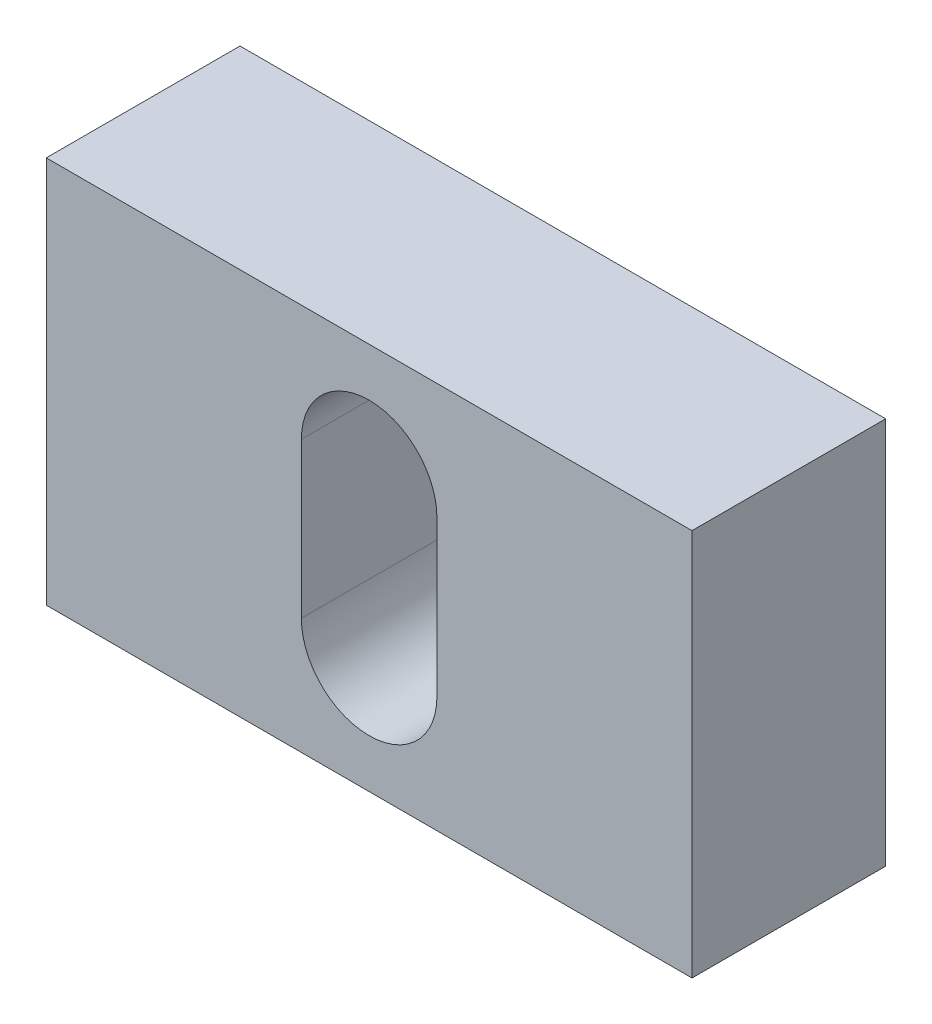
ISO-10303-21;
HEADER;
FILE_DESCRIPTION(('STEP AP214'),'2;1');
FILE_NAME('part.step','',(''),(''),'','','');
FILE_SCHEMA(('AUTOMOTIVE_DESIGN { 1 0 10303 214 1 1 1 1 }'));
ENDSEC;
DATA;
#1=APPLICATION_CONTEXT('core data for automotive mechanical design processes');
#2=APPLICATION_PROTOCOL_DEFINITION('international standard','automotive_design',2000,#1);
#3=PRODUCT_CONTEXT('',#1,'mechanical');
#4=PRODUCT('Part','Part','',(#3));
#5=PRODUCT_RELATED_PRODUCT_CATEGORY('part','',(#4));
#6=PRODUCT_DEFINITION_FORMATION('','',#4);
#7=PRODUCT_DEFINITION_CONTEXT('part definition',#1,'design');
#8=PRODUCT_DEFINITION('design','',#6,#7);
#9=PRODUCT_DEFINITION_SHAPE('','',#8);
#10=(LENGTH_UNIT() NAMED_UNIT(*) SI_UNIT(.MILLI.,.METRE.));
#11=(NAMED_UNIT(*) PLANE_ANGLE_UNIT() SI_UNIT($,.RADIAN.));
#12=(NAMED_UNIT(*) SI_UNIT($,.STERADIAN.) SOLID_ANGLE_UNIT());
#13=UNCERTAINTY_MEASURE_WITH_UNIT(LENGTH_MEASURE(1.E-05),#10,'distance_accuracy_value','');
#14=(GEOMETRIC_REPRESENTATION_CONTEXT(3) GLOBAL_UNCERTAINTY_ASSIGNED_CONTEXT((#13)) GLOBAL_UNIT_ASSIGNED_CONTEXT((#10,
#11,#12)) REPRESENTATION_CONTEXT('',''));
#15=CARTESIAN_POINT('',(0.,0.,0.));
#16=DIRECTION('',(0.,0.,1.));
#17=DIRECTION('',(1.,0.,0.));
#18=AXIS2_PLACEMENT_3D('',#15,#16,#17);
#19=CARTESIAN_POINT('',(-10.,-6.,6.));
#20=DIRECTION('',(0.,0.,1.));
#21=DIRECTION('',(1.,0.,0.));
#22=AXIS2_PLACEMENT_3D('',#19,#20,#21);
#23=PLANE('',#22);
#24=DIRECTION('',(0.,-1.,0.));
#25=VECTOR('',#24,1.);
#26=CARTESIAN_POINT('',(-10.,6.,6.));
#27=LINE('',#26,#25);
#28=CARTESIAN_POINT('',(-10.,6.,6.));
#29=VERTEX_POINT('',#28);
#30=CARTESIAN_POINT('',(-10.,-6.,6.));
#31=VERTEX_POINT('',#30);
#32=EDGE_CURVE('E135',#29,#31,#27,.T.);
#33=ORIENTED_EDGE('',*,*,#32,.T.);
#34=DIRECTION('',(1.,0.,0.));
#35=VECTOR('',#34,1.);
#36=CARTESIAN_POINT('',(-10.,-6.,6.));
#37=LINE('',#36,#35);
#38=CARTESIAN_POINT('',(10.,-6.,6.));
#39=VERTEX_POINT('',#38);
#40=EDGE_CURVE('E138',#31,#39,#37,.T.);
#41=ORIENTED_EDGE('',*,*,#40,.T.);
#42=DIRECTION('',(0.,1.,0.));
#43=VECTOR('',#42,1.);
#44=CARTESIAN_POINT('',(10.,6.,6.));
#45=LINE('',#44,#43);
#46=CARTESIAN_POINT('',(10.,6.,6.));
#47=VERTEX_POINT('',#46);
#48=EDGE_CURVE('E140',#39,#47,#45,.T.);
#49=ORIENTED_EDGE('',*,*,#48,.T.);
#50=DIRECTION('',(-1.,0.,0.));
#51=VECTOR('',#50,1.);
#52=CARTESIAN_POINT('',(-10.,6.,6.));
#53=LINE('',#52,#51);
#54=EDGE_CURVE('E142',#47,#29,#53,.T.);
#55=ORIENTED_EDGE('',*,*,#54,.T.);
#56=EDGE_LOOP('',(#33,#41,#49,#55));
#57=FACE_BOUND('',#56,.T.);
#58=DIRECTION('',(0.,-1.,0.));
#59=VECTOR('',#58,1.);
#60=CARTESIAN_POINT('',(-2.1,2.4,6.));
#61=LINE('',#60,#59);
#62=CARTESIAN_POINT('',(-2.1,2.4,6.));
#63=VERTEX_POINT('',#62);
#64=CARTESIAN_POINT('',(-2.1,-2.4,6.));
#65=VERTEX_POINT('',#64);
#66=EDGE_CURVE('E117',#63,#65,#61,.T.);
#67=ORIENTED_EDGE('',*,*,#66,.F.);
#68=CARTESIAN_POINT('',(0.,2.4,6.));
#69=DIRECTION('',(0.,0.,1.));
#70=DIRECTION('',(1.,0.,0.));
#71=AXIS2_PLACEMENT_3D('',#68,#69,#70);
#72=CIRCLE('',#71,2.1);
#73=CARTESIAN_POINT('',(2.1,2.4,6.));
#74=VERTEX_POINT('',#73);
#75=EDGE_CURVE('E106',#74,#63,#72,.T.);
#76=ORIENTED_EDGE('',*,*,#75,.F.);
#77=DIRECTION('',(0.,1.,0.));
#78=VECTOR('',#77,1.);
#79=CARTESIAN_POINT('',(2.1,-2.4,6.));
#80=LINE('',#79,#78);
#81=CARTESIAN_POINT('',(2.1,-2.4,6.));
#82=VERTEX_POINT('',#81);
#83=EDGE_CURVE('E121',#82,#74,#80,.T.);
#84=ORIENTED_EDGE('',*,*,#83,.F.);
#85=CARTESIAN_POINT('',(0.,-2.4,6.));
#86=DIRECTION('',(0.,0.,1.));
#87=DIRECTION('',(1.,0.,0.));
#88=AXIS2_PLACEMENT_3D('',#85,#86,#87);
#89=CIRCLE('',#88,2.1);
#90=EDGE_CURVE('E119',#65,#82,#89,.T.);
#91=ORIENTED_EDGE('',*,*,#90,.F.);
#92=EDGE_LOOP('',(#67,#76,#84,#91));
#93=FACE_BOUND('',#92,.T.);
#94=ADVANCED_FACE('F26',(#57,#93),#23,.T.);
#95=CARTESIAN_POINT('',(-10.,-6.,0.));
#96=DIRECTION('',(0.,0.,1.));
#97=DIRECTION('',(1.,0.,0.));
#98=AXIS2_PLACEMENT_3D('',#95,#96,#97);
#99=PLANE('',#98);
#100=DIRECTION('',(0.,-1.,0.));
#101=VECTOR('',#100,1.);
#102=CARTESIAN_POINT('',(-10.,6.,0.));
#103=LINE('',#102,#101);
#104=CARTESIAN_POINT('',(-10.,6.,0.));
#105=VERTEX_POINT('',#104);
#106=CARTESIAN_POINT('',(-10.,-6.,0.));
#107=VERTEX_POINT('',#106);
#108=EDGE_CURVE('E107',#105,#107,#103,.T.);
#109=ORIENTED_EDGE('',*,*,#108,.F.);
#110=DIRECTION('',(-1.,0.,0.));
#111=VECTOR('',#110,1.);
#112=CARTESIAN_POINT('',(-10.,6.,0.));
#113=LINE('',#112,#111);
#114=CARTESIAN_POINT('',(10.,6.,0.));
#115=VERTEX_POINT('',#114);
#116=EDGE_CURVE('E133',#115,#105,#113,.T.);
#117=ORIENTED_EDGE('',*,*,#116,.F.);
#118=DIRECTION('',(0.,1.,0.));
#119=VECTOR('',#118,1.);
#120=CARTESIAN_POINT('',(10.,6.,0.));
#121=LINE('',#120,#119);
#122=CARTESIAN_POINT('',(10.,-6.,0.));
#123=VERTEX_POINT('',#122);
#124=EDGE_CURVE('E131',#123,#115,#121,.T.);
#125=ORIENTED_EDGE('',*,*,#124,.F.);
#126=DIRECTION('',(1.,0.,0.));
#127=VECTOR('',#126,1.);
#128=CARTESIAN_POINT('',(-10.,-6.,0.));
#129=LINE('',#128,#127);
#130=EDGE_CURVE('E129',#107,#123,#129,.T.);
#131=ORIENTED_EDGE('',*,*,#130,.F.);
#132=EDGE_LOOP('',(#109,#117,#125,#131));
#133=FACE_BOUND('',#132,.T.);
#134=CARTESIAN_POINT('',(0.,2.4,0.));
#135=DIRECTION('',(0.,0.,1.));
#136=DIRECTION('',(1.,0.,0.));
#137=AXIS2_PLACEMENT_3D('',#134,#135,#136);
#138=CIRCLE('',#137,2.1);
#139=CARTESIAN_POINT('',(2.1,2.4,0.));
#140=VERTEX_POINT('',#139);
#141=CARTESIAN_POINT('',(-2.1,2.4,0.));
#142=VERTEX_POINT('',#141);
#143=EDGE_CURVE('E49',#140,#142,#138,.T.);
#144=ORIENTED_EDGE('',*,*,#143,.T.);
#145=DIRECTION('',(0.,-1.,0.));
#146=VECTOR('',#145,1.);
#147=CARTESIAN_POINT('',(-2.1,2.4,0.));
#148=LINE('',#147,#146);
#149=CARTESIAN_POINT('',(-2.1,-2.4,0.));
#150=VERTEX_POINT('',#149);
#151=EDGE_CURVE('E93',#142,#150,#148,.T.);
#152=ORIENTED_EDGE('',*,*,#151,.T.);
#153=CARTESIAN_POINT('',(0.,-2.4,0.));
#154=DIRECTION('',(0.,0.,1.));
#155=DIRECTION('',(1.,0.,0.));
#156=AXIS2_PLACEMENT_3D('',#153,#154,#155);
#157=CIRCLE('',#156,2.1);
#158=CARTESIAN_POINT('',(2.1,-2.4,0.));
#159=VERTEX_POINT('',#158);
#160=EDGE_CURVE('E102',#150,#159,#157,.T.);
#161=ORIENTED_EDGE('',*,*,#160,.T.);
#162=DIRECTION('',(0.,1.,0.));
#163=VECTOR('',#162,1.);
#164=CARTESIAN_POINT('',(2.1,-2.4,0.));
#165=LINE('',#164,#163);
#166=EDGE_CURVE('E111',#159,#140,#165,.T.);
#167=ORIENTED_EDGE('',*,*,#166,.T.);
#168=EDGE_LOOP('',(#144,#152,#161,#167));
#169=FACE_BOUND('',#168,.T.);
#170=ADVANCED_FACE('F110',(#133,#169),#99,.F.);
#171=CARTESIAN_POINT('',(-10.,6.,6.));
#172=DIRECTION('',(1.,0.,0.));
#173=DIRECTION('',(0.,1.,0.));
#174=AXIS2_PLACEMENT_3D('',#171,#172,#173);
#175=PLANE('',#174);
#176=ORIENTED_EDGE('',*,*,#108,.T.);
#177=DIRECTION('',(0.,0.,-1.));
#178=VECTOR('',#177,1.);
#179=CARTESIAN_POINT('',(-10.,-6.,6.));
#180=LINE('',#179,#178);
#181=EDGE_CURVE('E11',#31,#107,#180,.T.);
#182=ORIENTED_EDGE('',*,*,#181,.F.);
#183=ORIENTED_EDGE('',*,*,#32,.F.);
#184=DIRECTION('',(0.,0.,-1.));
#185=VECTOR('',#184,1.);
#186=CARTESIAN_POINT('',(-10.,6.,6.));
#187=LINE('',#186,#185);
#188=EDGE_CURVE('E144',#29,#105,#187,.T.);
#189=ORIENTED_EDGE('',*,*,#188,.T.);
#190=EDGE_LOOP('',(#176,#182,#183,#189));
#191=FACE_BOUND('',#190,.T.);
#192=ADVANCED_FACE('F28',(#191),#175,.F.);
#193=CARTESIAN_POINT('',(-10.,-6.,6.));
#194=DIRECTION('',(0.,1.,0.));
#195=DIRECTION('',(-1.,0.,0.));
#196=AXIS2_PLACEMENT_3D('',#193,#194,#195);
#197=PLANE('',#196);
#198=ORIENTED_EDGE('',*,*,#130,.T.);
#199=DIRECTION('',(0.,0.,-1.));
#200=VECTOR('',#199,1.);
#201=CARTESIAN_POINT('',(10.,-6.,6.));
#202=LINE('',#201,#200);
#203=EDGE_CURVE('E34',#39,#123,#202,.T.);
#204=ORIENTED_EDGE('',*,*,#203,.F.);
#205=ORIENTED_EDGE('',*,*,#40,.F.);
#206=ORIENTED_EDGE('',*,*,#181,.T.);
#207=EDGE_LOOP('',(#198,#204,#205,#206));
#208=FACE_BOUND('',#207,.T.);
#209=ADVANCED_FACE('F169',(#208),#197,.F.);
#210=CARTESIAN_POINT('',(10.,6.,6.));
#211=DIRECTION('',(-1.,0.,0.));
#212=DIRECTION('',(0.,0.,1.));
#213=AXIS2_PLACEMENT_3D('',#210,#211,#212);
#214=PLANE('',#213);
#215=ORIENTED_EDGE('',*,*,#124,.T.);
#216=DIRECTION('',(0.,0.,-1.));
#217=VECTOR('',#216,1.);
#218=CARTESIAN_POINT('',(10.,6.,6.));
#219=LINE('',#218,#217);
#220=EDGE_CURVE('E147',#47,#115,#219,.T.);
#221=ORIENTED_EDGE('',*,*,#220,.F.);
#222=ORIENTED_EDGE('',*,*,#48,.F.);
#223=ORIENTED_EDGE('',*,*,#203,.T.);
#224=EDGE_LOOP('',(#215,#221,#222,#223));
#225=FACE_BOUND('',#224,.T.);
#226=ADVANCED_FACE('F154',(#225),#214,.F.);
#227=CARTESIAN_POINT('',(-10.,6.,6.));
#228=DIRECTION('',(0.,-1.,0.));
#229=DIRECTION('',(1.,0.,0.));
#230=AXIS2_PLACEMENT_3D('',#227,#228,#229);
#231=PLANE('',#230);
#232=ORIENTED_EDGE('',*,*,#116,.T.);
#233=ORIENTED_EDGE('',*,*,#188,.F.);
#234=ORIENTED_EDGE('',*,*,#54,.F.);
#235=ORIENTED_EDGE('',*,*,#220,.T.);
#236=EDGE_LOOP('',(#232,#233,#234,#235));
#237=FACE_BOUND('',#236,.T.);
#238=ADVANCED_FACE('F162',(#237),#231,.F.);
#239=CARTESIAN_POINT('',(0.,2.4,6.));
#240=DIRECTION('',(0.,0.,-1.));
#241=DIRECTION('',(-1.,0.,0.));
#242=AXIS2_PLACEMENT_3D('',#239,#240,#241);
#243=CYLINDRICAL_SURFACE('',#242,2.1);
#244=ORIENTED_EDGE('',*,*,#143,.F.);
#245=DIRECTION('',(0.,0.,-1.));
#246=VECTOR('',#245,1.);
#247=CARTESIAN_POINT('',(2.1,2.4,6.));
#248=LINE('',#247,#246);
#249=EDGE_CURVE('E123',#74,#140,#248,.T.);
#250=ORIENTED_EDGE('',*,*,#249,.F.);
#251=ORIENTED_EDGE('',*,*,#75,.T.);
#252=DIRECTION('',(0.,0.,-1.));
#253=VECTOR('',#252,1.);
#254=CARTESIAN_POINT('',(-2.1,2.4,6.));
#255=LINE('',#254,#253);
#256=EDGE_CURVE('E95',#63,#142,#255,.T.);
#257=ORIENTED_EDGE('',*,*,#256,.T.);
#258=EDGE_LOOP('',(#244,#250,#251,#257));
#259=FACE_BOUND('',#258,.T.);
#260=ADVANCED_FACE('F104',(#259),#243,.F.);
#261=CARTESIAN_POINT('',(-2.1,2.4,6.));
#262=DIRECTION('',(1.,0.,0.));
#263=DIRECTION('',(0.,1.,0.));
#264=AXIS2_PLACEMENT_3D('',#261,#262,#263);
#265=PLANE('',#264);
#266=ORIENTED_EDGE('',*,*,#151,.F.);
#267=ORIENTED_EDGE('',*,*,#256,.F.);
#268=ORIENTED_EDGE('',*,*,#66,.T.);
#269=DIRECTION('',(0.,0.,-1.));
#270=VECTOR('',#269,1.);
#271=CARTESIAN_POINT('',(-2.1,-2.4,6.));
#272=LINE('',#271,#270);
#273=EDGE_CURVE('E98',#65,#150,#272,.T.);
#274=ORIENTED_EDGE('',*,*,#273,.T.);
#275=EDGE_LOOP('',(#266,#267,#268,#274));
#276=FACE_BOUND('',#275,.T.);
#277=ADVANCED_FACE('F94',(#276),#265,.T.);
#278=CARTESIAN_POINT('',(0.,-2.4,6.));
#279=DIRECTION('',(0.,0.,-1.));
#280=DIRECTION('',(-1.,0.,0.));
#281=AXIS2_PLACEMENT_3D('',#278,#279,#280);
#282=CYLINDRICAL_SURFACE('',#281,2.1);
#283=ORIENTED_EDGE('',*,*,#160,.F.);
#284=ORIENTED_EDGE('',*,*,#273,.F.);
#285=ORIENTED_EDGE('',*,*,#90,.T.);
#286=DIRECTION('',(0.,0.,-1.));
#287=VECTOR('',#286,1.);
#288=CARTESIAN_POINT('',(2.1,-2.4,6.));
#289=LINE('',#288,#287);
#290=EDGE_CURVE('E41',#82,#159,#289,.T.);
#291=ORIENTED_EDGE('',*,*,#290,.T.);
#292=EDGE_LOOP('',(#283,#284,#285,#291));
#293=FACE_BOUND('',#292,.T.);
#294=ADVANCED_FACE('F191',(#293),#282,.F.);
#295=CARTESIAN_POINT('',(2.1,-2.4,6.));
#296=DIRECTION('',(-1.,0.,0.));
#297=DIRECTION('',(0.,-1.,0.));
#298=AXIS2_PLACEMENT_3D('',#295,#296,#297);
#299=PLANE('',#298);
#300=ORIENTED_EDGE('',*,*,#166,.F.);
#301=ORIENTED_EDGE('',*,*,#290,.F.);
#302=ORIENTED_EDGE('',*,*,#83,.T.);
#303=ORIENTED_EDGE('',*,*,#249,.T.);
#304=EDGE_LOOP('',(#300,#301,#302,#303));
#305=FACE_BOUND('',#304,.T.);
#306=ADVANCED_FACE('F196',(#305),#299,.T.);
#307=CLOSED_SHELL('',(#94,#170,#192,#209,#226,#238,#260,#277,#294,#306));
#308=MANIFOLD_SOLID_BREP('B2',#307);
#309=ADVANCED_BREP_SHAPE_REPRESENTATION('',(#18,#308),#14);
#310=SHAPE_DEFINITION_REPRESENTATION(#9,#309);
ENDSEC;
END-ISO-10303-21;
